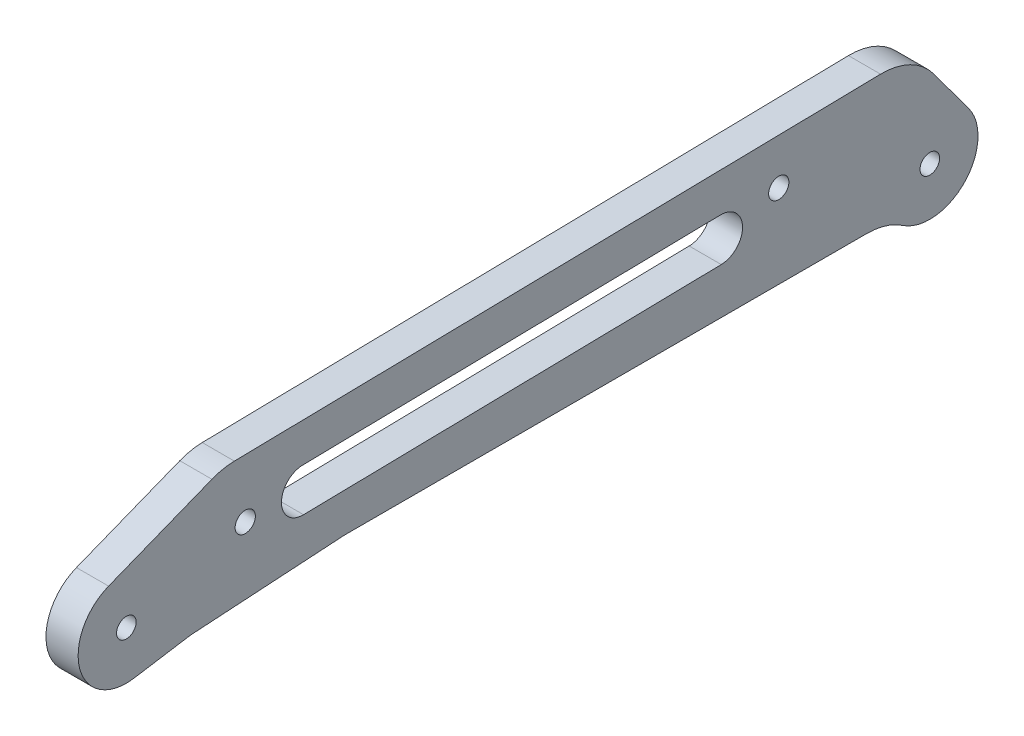
ISO-10303-21;
HEADER;
FILE_DESCRIPTION(('STEP AP214'),'2;1');
FILE_NAME('part.step','',(''),(''),'','','');
FILE_SCHEMA(('AUTOMOTIVE_DESIGN { 1 0 10303 214 1 1 1 1 }'));
ENDSEC;
DATA;
#1=APPLICATION_CONTEXT('core data for automotive mechanical design processes');
#2=APPLICATION_PROTOCOL_DEFINITION('international standard','automotive_design',2000,#1);
#3=PRODUCT_CONTEXT('',#1,'mechanical');
#4=PRODUCT('Part','Part','',(#3));
#5=PRODUCT_RELATED_PRODUCT_CATEGORY('part','',(#4));
#6=PRODUCT_DEFINITION_FORMATION('','',#4);
#7=PRODUCT_DEFINITION_CONTEXT('part definition',#1,'design');
#8=PRODUCT_DEFINITION('design','',#6,#7);
#9=PRODUCT_DEFINITION_SHAPE('','',#8);
#10=(LENGTH_UNIT() NAMED_UNIT(*) SI_UNIT(.MILLI.,.METRE.));
#11=(NAMED_UNIT(*) PLANE_ANGLE_UNIT() SI_UNIT($,.RADIAN.));
#12=(NAMED_UNIT(*) SI_UNIT($,.STERADIAN.) SOLID_ANGLE_UNIT());
#13=UNCERTAINTY_MEASURE_WITH_UNIT(LENGTH_MEASURE(1.E-05),#10,'distance_accuracy_value','');
#14=(GEOMETRIC_REPRESENTATION_CONTEXT(3) GLOBAL_UNCERTAINTY_ASSIGNED_CONTEXT((#13)) GLOBAL_UNIT_ASSIGNED_CONTEXT((#10,
#11,#12)) REPRESENTATION_CONTEXT('',''));
#15=CARTESIAN_POINT('',(0.,0.,0.));
#16=DIRECTION('',(0.,0.,1.));
#17=DIRECTION('',(1.,0.,0.));
#18=AXIS2_PLACEMENT_3D('',#15,#16,#17);
#19=CARTESIAN_POINT('',(2.5,-15.9506465412037,113.898149240446));
#20=DIRECTION('',(-1.,0.,0.));
#21=DIRECTION('',(0.,0.,1.));
#22=AXIS2_PLACEMENT_3D('',#19,#20,#21);
#23=CYLINDRICAL_SURFACE('',#22,9.99999999999999);
#24=DIRECTION('',(1.,0.,0.));
#25=VECTOR('',#24,1.);
#26=CARTESIAN_POINT('',(2.5,-6.0754365781553,115.473023262617));
#27=LINE('',#26,#25);
#28=CARTESIAN_POINT('',(-2.5,-6.0754365781553,115.473023262617));
#29=VERTEX_POINT('',#28);
#30=CARTESIAN_POINT('',(2.5,-6.0754365781553,115.473023262617));
#31=VERTEX_POINT('',#30);
#32=EDGE_CURVE('E142',#29,#31,#27,.T.);
#33=ORIENTED_EDGE('',*,*,#32,.F.);
#34=CARTESIAN_POINT('',(-2.5,-15.9506465412037,113.898149240446));
#35=DIRECTION('',(-1.,0.,0.));
#36=DIRECTION('',(0.,0.,1.));
#37=AXIS2_PLACEMENT_3D('',#34,#35,#36);
#38=CIRCLE('',#37,9.99999999999999);
#39=CARTESIAN_POINT('',(-2.5,-5.97012075637485,114.521932101997));
#40=VERTEX_POINT('',#39);
#41=EDGE_CURVE('E19',#40,#29,#38,.F.);
#42=ORIENTED_EDGE('',*,*,#41,.F.);
#43=DIRECTION('',(1.,0.,0.));
#44=VECTOR('',#43,1.);
#45=CARTESIAN_POINT('',(2.5,-5.97012075637486,114.521932101997));
#46=LINE('',#45,#44);
#47=CARTESIAN_POINT('',(2.5,-5.97012075637485,114.521932101997));
#48=VERTEX_POINT('',#47);
#49=EDGE_CURVE('E206',#40,#48,#46,.T.);
#50=ORIENTED_EDGE('',*,*,#49,.T.);
#51=CARTESIAN_POINT('',(2.5,-15.9506465412037,113.898149240446));
#52=DIRECTION('',(-1.,0.,0.));
#53=DIRECTION('',(0.,0.,1.));
#54=AXIS2_PLACEMENT_3D('',#51,#52,#53);
#55=CIRCLE('',#54,9.99999999999999);
#56=EDGE_CURVE('E140',#31,#48,#55,.T.);
#57=ORIENTED_EDGE('',*,*,#56,.F.);
#58=EDGE_LOOP('',(#33,#42,#50,#57));
#59=FACE_BOUND('',#58,.T.);
#60=ADVANCED_FACE('F16',(#59),#23,.F.);
#61=CARTESIAN_POINT('',(2.5,0.,0.));
#62=DIRECTION('',(1.,0.,0.));
#63=DIRECTION('',(0.,0.,-1.));
#64=AXIS2_PLACEMENT_3D('',#61,#62,#63);
#65=PLANE('',#64);
#66=CARTESIAN_POINT('',(2.5,0.,125.));
#67=DIRECTION('',(-1.,0.,0.));
#68=DIRECTION('',(0.,0.,1.));
#69=AXIS2_PLACEMENT_3D('',#66,#67,#68);
#70=CIRCLE('',#69,1.525);
#71=CARTESIAN_POINT('',(2.5,0.,126.525));
#72=VERTEX_POINT('',#71);
#73=EDGE_CURVE('E255',#72,#72,#70,.T.);
#74=ORIENTED_EDGE('',*,*,#73,.T.);
#75=EDGE_LOOP('',(#74));
#76=FACE_BOUND('',#75,.T.);
#77=CARTESIAN_POINT('',(2.5,8.49999999999999,23.5));
#78=DIRECTION('',(-1.,0.,0.));
#79=DIRECTION('',(0.,0.,1.));
#80=AXIS2_PLACEMENT_3D('',#77,#78,#79);
#81=CIRCLE('',#80,1.575);
#82=CARTESIAN_POINT('',(2.5,8.49999999999999,25.075));
#83=VERTEX_POINT('',#82);
#84=EDGE_CURVE('E167',#83,#83,#81,.T.);
#85=ORIENTED_EDGE('',*,*,#84,.T.);
#86=EDGE_LOOP('',(#85));
#87=FACE_BOUND('',#86,.T.);
#88=CARTESIAN_POINT('',(2.5,4.80591857120444,97.4943767977606));
#89=DIRECTION('',(-1.,0.,0.));
#90=DIRECTION('',(0.,0.,1.));
#91=AXIS2_PLACEMENT_3D('',#88,#89,#90);
#92=CIRCLE('',#91,3.375);
#93=CARTESIAN_POINT('',(2.5,1.43150251912931,97.4315969642336));
#94=VERTEX_POINT('',#93);
#95=CARTESIAN_POINT('',(2.5,8.18033462327958,97.5571566312875));
#96=VERTEX_POINT('',#95);
#97=EDGE_CURVE('E174',#94,#96,#92,.T.);
#98=ORIENTED_EDGE('',*,*,#97,.T.);
#99=DIRECTION('',(0.,-0.0186014321561423,0.999826978392632));
#100=VECTOR('',#99,1.);
#101=CARTESIAN_POINT('',(2.5,9.99189296650175,0.18589568309771));
#102=LINE('',#101,#100);
#103=CARTESIAN_POINT('',(2.5,9.38942771342883,32.5684030357665));
#104=VERTEX_POINT('',#103);
#105=EDGE_CURVE('E170',#96,#104,#102,.F.);
#106=ORIENTED_EDGE('',*,*,#105,.T.);
#107=CARTESIAN_POINT('',(2.5,6.01501166135369,32.5056232022395));
#108=DIRECTION('',(-1.,0.,0.));
#109=DIRECTION('',(0.,0.,1.));
#110=AXIS2_PLACEMENT_3D('',#107,#108,#109);
#111=CIRCLE('',#110,3.375);
#112=CARTESIAN_POINT('',(2.5,2.64059560927856,32.4428433687125));
#113=VERTEX_POINT('',#112);
#114=EDGE_CURVE('E168',#104,#113,#111,.T.);
#115=ORIENTED_EDGE('',*,*,#114,.T.);
#116=DIRECTION('',(0.,-0.0186014321561423,0.999826978392632));
#117=VECTOR('',#116,1.);
#118=CARTESIAN_POINT('',(2.5,3.24306086235148,0.0603360160437494));
#119=LINE('',#118,#117);
#120=EDGE_CURVE('E178',#94,#113,#119,.F.);
#121=ORIENTED_EDGE('',*,*,#120,.F.);
#122=EDGE_LOOP('',(#98,#106,#115,#121));
#123=FACE_BOUND('',#122,.T.);
#124=CARTESIAN_POINT('',(2.5,4.99999999999999,106.5));
#125=DIRECTION('',(-1.,0.,0.));
#126=DIRECTION('',(0.,0.,1.));
#127=AXIS2_PLACEMENT_3D('',#124,#125,#126);
#128=CIRCLE('',#127,1.57499999999999);
#129=CARTESIAN_POINT('',(2.5,4.99999999999999,108.075));
#130=VERTEX_POINT('',#129);
#131=EDGE_CURVE('E185',#130,#130,#128,.T.);
#132=ORIENTED_EDGE('',*,*,#131,.T.);
#133=EDGE_LOOP('',(#132));
#134=FACE_BOUND('',#133,.T.);
#135=CARTESIAN_POINT('',(2.5,-14.5,9.7979589711327));
#136=DIRECTION('',(-1.,0.,0.));
#137=DIRECTION('',(0.,0.,1.));
#138=AXIS2_PLACEMENT_3D('',#135,#136,#137);
#139=CIRCLE('',#138,10.);
#140=CARTESIAN_POINT('',(2.5,-4.50000000000001,9.7979589711327));
#141=VERTEX_POINT('',#140);
#142=CARTESIAN_POINT('',(2.5,-6.21428571428572,4.19912527334258));
#143=VERTEX_POINT('',#142);
#144=EDGE_CURVE('E198',#141,#143,#139,.T.);
#145=ORIENTED_EDGE('',*,*,#144,.T.);
#146=CARTESIAN_POINT('',(2.5,0.,0.));
#147=DIRECTION('',(-1.,0.,0.));
#148=DIRECTION('',(0.,0.,1.));
#149=AXIS2_PLACEMENT_3D('',#146,#147,#148);
#150=CIRCLE('',#149,7.5);
#151=CARTESIAN_POINT('',(2.5,4.4580100162827,-6.03126410420926));
#152=VERTEX_POINT('',#151);
#153=EDGE_CURVE('E194',#152,#143,#150,.T.);
#154=ORIENTED_EDGE('',*,*,#153,.F.);
#155=DIRECTION('',(0.,0.804168547227902,0.59440133550436));
#156=VECTOR('',#155,1.);
#157=CARTESIAN_POINT('',(2.5,4.4580100162827,-6.03126410420926));
#158=LINE('',#157,#156);
#159=CARTESIAN_POINT('',(2.5,11.8497428928066,-0.567663334640593));
#160=VERTEX_POINT('',#159);
#161=EDGE_CURVE('E191',#160,#152,#158,.F.);
#162=ORIENTED_EDGE('',*,*,#161,.F.);
#163=CARTESIAN_POINT('',(2.5,5.90572953776299,7.47402213763842));
#164=DIRECTION('',(-1.,0.,0.));
#165=DIRECTION('',(0.,0.,1.));
#166=AXIS2_PLACEMENT_3D('',#163,#164,#165);
#167=CIRCLE('',#166,10.);
#168=CARTESIAN_POINT('',(2.5,15.9039993216893,7.66003645919984));
#169=VERTEX_POINT('',#168);
#170=EDGE_CURVE('E188',#169,#160,#167,.T.);
#171=ORIENTED_EDGE('',*,*,#170,.F.);
#172=DIRECTION('',(0.,-0.0186014321561421,0.999826978392632));
#173=VECTOR('',#172,1.);
#174=CARTESIAN_POINT('',(2.5,16.040959321814,0.298436452498867));
#175=LINE('',#174,#173);
#176=CARTESIAN_POINT('',(2.5,14.0336689941836,108.190291562629));
#177=VERTEX_POINT('',#176);
#178=EDGE_CURVE('E182',#177,#169,#175,.F.);
#179=ORIENTED_EDGE('',*,*,#178,.F.);
#180=CARTESIAN_POINT('',(2.5,4.03539921025731,108.004277241067));
#181=DIRECTION('',(-1.,0.,0.));
#182=DIRECTION('',(0.,0.,1.));
#183=AXIS2_PLACEMENT_3D('',#180,#181,#182);
#184=CIRCLE('',#183,9.99999999999999);
#185=CARTESIAN_POINT('',(2.5,13.3341269732446,111.683089819856));
#186=VERTEX_POINT('',#185);
#187=EDGE_CURVE('E226',#186,#177,#184,.T.);
#188=ORIENTED_EDGE('',*,*,#187,.F.);
#189=DIRECTION('',(0.,-0.367881257878812,0.929872776298727));
#190=VECTOR('',#189,1.);
#191=CARTESIAN_POINT('',(2.5,49.7343916487453,19.6761869214032));
#192=LINE('',#191,#190);
#193=CARTESIAN_POINT('',(2.5,6.97404582224044,127.759109434091));
#194=VERTEX_POINT('',#193);
#195=EDGE_CURVE('E213',#194,#186,#192,.F.);
#196=ORIENTED_EDGE('',*,*,#195,.F.);
#197=CARTESIAN_POINT('',(2.5,0.,125.));
#198=DIRECTION('',(-1.,0.,0.));
#199=DIRECTION('',(0.,0.,1.));
#200=AXIS2_PLACEMENT_3D('',#197,#198,#199);
#201=CIRCLE('',#200,7.50000000000001);
#202=CARTESIAN_POINT('',(2.5,-7.40640747228635,123.818844483372));
#203=VERTEX_POINT('',#202);
#204=EDGE_CURVE('E146',#203,#194,#201,.T.);
#205=ORIENTED_EDGE('',*,*,#204,.F.);
#206=DIRECTION('',(0.,0.157487402217094,-0.987520996304844));
#207=VECTOR('',#206,1.);
#208=CARTESIAN_POINT('',(2.5,12.0338570705745,1.9191297155079));
#209=LINE('',#208,#207);
#210=EDGE_CURVE('E145',#31,#203,#209,.F.);
#211=ORIENTED_EDGE('',*,*,#210,.F.);
#212=ORIENTED_EDGE('',*,*,#56,.T.);
#213=DIRECTION('',(0.,-0.0623782861551807,0.998052578482889));
#214=VECTOR('',#213,1.);
#215=CARTESIAN_POINT('',(2.5,1.18287937743191,0.0739299610894947));
#216=LINE('',#215,#214);
#217=CARTESIAN_POINT('',(2.5,-4.50000000000001,91.));
#218=VERTEX_POINT('',#217);
#219=EDGE_CURVE('E203',#48,#218,#216,.F.);
#220=ORIENTED_EDGE('',*,*,#219,.T.);
#221=DIRECTION('',(0.,0.,1.));
#222=VECTOR('',#221,1.);
#223=CARTESIAN_POINT('',(2.5,-4.50000000000001,0.));
#224=LINE('',#223,#222);
#225=EDGE_CURVE('E199',#218,#141,#224,.F.);
#226=ORIENTED_EDGE('',*,*,#225,.T.);
#227=EDGE_LOOP('',(#145,#154,#162,#171,#179,#188,#196,#205,#211,#212,#220,#226));
#228=FACE_BOUND('',#227,.T.);
#229=CARTESIAN_POINT('',(2.5,0.,0.));
#230=DIRECTION('',(-1.,0.,0.));
#231=DIRECTION('',(0.,0.,1.));
#232=AXIS2_PLACEMENT_3D('',#229,#230,#231);
#233=CIRCLE('',#232,1.525);
#234=CARTESIAN_POINT('',(2.5,0.,1.525));
#235=VERTEX_POINT('',#234);
#236=EDGE_CURVE('E271',#235,#235,#233,.T.);
#237=ORIENTED_EDGE('',*,*,#236,.T.);
#238=EDGE_LOOP('',(#237));
#239=FACE_BOUND('',#238,.T.);
#240=ADVANCED_FACE('F275',(#76,#87,#123,#134,#228,#239),#65,.T.);
#241=CARTESIAN_POINT('',(2.5,0.,0.));
#242=DIRECTION('',(-1.,0.,0.));
#243=DIRECTION('',(0.,0.,1.));
#244=AXIS2_PLACEMENT_3D('',#241,#242,#243);
#245=CYLINDRICAL_SURFACE('',#244,1.525);
#246=CARTESIAN_POINT('',(-2.5,0.,0.));
#247=DIRECTION('',(-1.,0.,0.));
#248=DIRECTION('',(0.,0.,1.));
#249=AXIS2_PLACEMENT_3D('',#246,#247,#248);
#250=CIRCLE('',#249,1.525);
#251=CARTESIAN_POINT('',(-2.5,0.,1.525));
#252=VERTEX_POINT('',#251);
#253=EDGE_CURVE('E252',#252,#252,#250,.T.);
#254=ORIENTED_EDGE('',*,*,#253,.T.);
#255=EDGE_LOOP('',(#254));
#256=FACE_BOUND('',#255,.T.);
#257=ORIENTED_EDGE('',*,*,#236,.F.);
#258=EDGE_LOOP('',(#257));
#259=FACE_BOUND('',#258,.T.);
#260=ADVANCED_FACE('F485',(#256,#259),#245,.F.);
#261=CARTESIAN_POINT('',(2.5,4.03539921025731,108.004277241067));
#262=DIRECTION('',(-1.,0.,0.));
#263=DIRECTION('',(0.,0.,1.));
#264=AXIS2_PLACEMENT_3D('',#261,#262,#263);
#265=CYLINDRICAL_SURFACE('',#264,9.99999999999999);
#266=CARTESIAN_POINT('',(-2.5,4.03539921025731,108.004277241067));
#267=DIRECTION('',(-1.,0.,0.));
#268=DIRECTION('',(0.,0.,1.));
#269=AXIS2_PLACEMENT_3D('',#266,#267,#268);
#270=CIRCLE('',#269,9.99999999999999);
#271=CARTESIAN_POINT('',(-2.5,14.0336689941836,108.190291562629));
#272=VERTEX_POINT('',#271);
#273=CARTESIAN_POINT('',(-2.5,13.3341269732446,111.683089819856));
#274=VERTEX_POINT('',#273);
#275=EDGE_CURVE('E163',#272,#274,#270,.F.);
#276=ORIENTED_EDGE('',*,*,#275,.T.);
#277=DIRECTION('',(1.,0.,0.));
#278=VECTOR('',#277,1.);
#279=CARTESIAN_POINT('',(2.5,13.3341269732446,111.683089819856));
#280=LINE('',#279,#278);
#281=EDGE_CURVE('E211',#186,#274,#280,.F.);
#282=ORIENTED_EDGE('',*,*,#281,.F.);
#283=ORIENTED_EDGE('',*,*,#187,.T.);
#284=DIRECTION('',(1.,0.,0.));
#285=VECTOR('',#284,1.);
#286=CARTESIAN_POINT('',(2.5,14.0336689941836,108.190291562629));
#287=LINE('',#286,#285);
#288=EDGE_CURVE('E181',#272,#177,#287,.T.);
#289=ORIENTED_EDGE('',*,*,#288,.F.);
#290=EDGE_LOOP('',(#276,#282,#283,#289));
#291=FACE_BOUND('',#290,.T.);
#292=ADVANCED_FACE('F476',(#291),#265,.T.);
#293=CARTESIAN_POINT('',(2.5,49.7343916487453,19.6761869214032));
#294=DIRECTION('',(0.,0.929872776298727,0.367881257878812));
#295=DIRECTION('',(0.,-0.367881257878812,0.929872776298727));
#296=AXIS2_PLACEMENT_3D('',#293,#294,#295);
#297=PLANE('',#296);
#298=DIRECTION('',(0.,-0.367881257878812,0.929872776298727));
#299=VECTOR('',#298,1.);
#300=CARTESIAN_POINT('',(-2.5,13.3341269732446,111.683089819856));
#301=LINE('',#300,#299);
#302=CARTESIAN_POINT('',(-2.5,6.97404582224044,127.759109434091));
#303=VERTEX_POINT('',#302);
#304=EDGE_CURVE('E156',#274,#303,#301,.T.);
#305=ORIENTED_EDGE('',*,*,#304,.T.);
#306=DIRECTION('',(-1.,0.,0.));
#307=VECTOR('',#306,1.);
#308=CARTESIAN_POINT('',(2.5,6.97404582224044,127.759109434091));
#309=LINE('',#308,#307);
#310=EDGE_CURVE('E209',#194,#303,#309,.T.);
#311=ORIENTED_EDGE('',*,*,#310,.F.);
#312=ORIENTED_EDGE('',*,*,#195,.T.);
#313=ORIENTED_EDGE('',*,*,#281,.T.);
#314=EDGE_LOOP('',(#305,#311,#312,#313));
#315=FACE_BOUND('',#314,.T.);
#316=ADVANCED_FACE('F467',(#315),#297,.T.);
#317=CARTESIAN_POINT('',(2.5,0.,125.));
#318=DIRECTION('',(-1.,0.,0.));
#319=DIRECTION('',(0.,0.,1.));
#320=AXIS2_PLACEMENT_3D('',#317,#318,#319);
#321=CYLINDRICAL_SURFACE('',#320,7.50000000000001);
#322=CARTESIAN_POINT('',(-2.5,0.,125.));
#323=DIRECTION('',(-1.,0.,0.));
#324=DIRECTION('',(0.,0.,1.));
#325=AXIS2_PLACEMENT_3D('',#322,#323,#324);
#326=CIRCLE('',#325,7.50000000000001);
#327=CARTESIAN_POINT('',(-2.5,-7.40640747228635,123.818844483372));
#328=VERTEX_POINT('',#327);
#329=EDGE_CURVE('E152',#303,#328,#326,.F.);
#330=ORIENTED_EDGE('',*,*,#329,.T.);
#331=DIRECTION('',(1.,0.,0.));
#332=VECTOR('',#331,1.);
#333=CARTESIAN_POINT('',(2.5,-7.40640747228635,123.818844483372));
#334=LINE('',#333,#332);
#335=EDGE_CURVE('E151',#203,#328,#334,.F.);
#336=ORIENTED_EDGE('',*,*,#335,.F.);
#337=ORIENTED_EDGE('',*,*,#204,.T.);
#338=ORIENTED_EDGE('',*,*,#310,.T.);
#339=EDGE_LOOP('',(#330,#336,#337,#338));
#340=FACE_BOUND('',#339,.T.);
#341=ADVANCED_FACE('F459',(#340),#321,.T.);
#342=CARTESIAN_POINT('',(2.5,12.0338570705745,1.9191297155079));
#343=DIRECTION('',(0.,-0.987520996304844,-0.157487402217094));
#344=DIRECTION('',(0.,0.157487402217094,-0.987520996304844));
#345=AXIS2_PLACEMENT_3D('',#342,#343,#344);
#346=PLANE('',#345);
#347=ORIENTED_EDGE('',*,*,#210,.T.);
#348=ORIENTED_EDGE('',*,*,#335,.T.);
#349=DIRECTION('',(0.,0.157487402217095,-0.987520996304844));
#350=VECTOR('',#349,1.);
#351=CARTESIAN_POINT('',(-2.5,-7.40640747228635,123.818844483372));
#352=LINE('',#351,#350);
#353=EDGE_CURVE('E136',#328,#29,#352,.T.);
#354=ORIENTED_EDGE('',*,*,#353,.T.);
#355=ORIENTED_EDGE('',*,*,#32,.T.);
#356=EDGE_LOOP('',(#347,#348,#354,#355));
#357=FACE_BOUND('',#356,.T.);
#358=ADVANCED_FACE('F149',(#357),#346,.T.);
#359=CARTESIAN_POINT('',(2.5,1.18287937743191,0.0739299610894947));
#360=DIRECTION('',(0.,0.998052578482889,0.0623782861551807));
#361=DIRECTION('',(0.,-0.0623782861551807,0.998052578482889));
#362=AXIS2_PLACEMENT_3D('',#359,#360,#361);
#363=PLANE('',#362);
#364=ORIENTED_EDGE('',*,*,#49,.F.);
#365=DIRECTION('',(0.,0.0623782861551807,-0.998052578482889));
#366=VECTOR('',#365,1.);
#367=CARTESIAN_POINT('',(-2.5,-5.97012075637486,114.521932101997));
#368=LINE('',#367,#366);
#369=CARTESIAN_POINT('',(-2.5,-4.50000000000003,91.0000000000006));
#370=VERTEX_POINT('',#369);
#371=EDGE_CURVE('E139',#40,#370,#368,.T.);
#372=ORIENTED_EDGE('',*,*,#371,.T.);
#373=DIRECTION('',(1.,0.,0.));
#374=VECTOR('',#373,1.);
#375=CARTESIAN_POINT('',(2.5,-4.50000000000001,91.));
#376=LINE('',#375,#374);
#377=EDGE_CURVE('E200',#370,#218,#376,.T.);
#378=ORIENTED_EDGE('',*,*,#377,.T.);
#379=ORIENTED_EDGE('',*,*,#219,.F.);
#380=EDGE_LOOP('',(#364,#372,#378,#379));
#381=FACE_BOUND('',#380,.T.);
#382=ADVANCED_FACE('F280',(#381),#363,.F.);
#383=CARTESIAN_POINT('',(2.5,-4.50000000000001,0.));
#384=DIRECTION('',(0.,1.,0.));
#385=DIRECTION('',(0.,0.,1.));
#386=AXIS2_PLACEMENT_3D('',#383,#384,#385);
#387=PLANE('',#386);
#388=DIRECTION('',(-1.,0.,0.));
#389=VECTOR('',#388,1.);
#390=CARTESIAN_POINT('',(2.5,-4.50000000000001,9.7979589711327));
#391=LINE('',#390,#389);
#392=CARTESIAN_POINT('',(-2.5,-4.50000000000001,9.7979589711327));
#393=VERTEX_POINT('',#392);
#394=EDGE_CURVE('E195',#393,#141,#391,.F.);
#395=ORIENTED_EDGE('',*,*,#394,.T.);
#396=ORIENTED_EDGE('',*,*,#225,.F.);
#397=ORIENTED_EDGE('',*,*,#377,.F.);
#398=DIRECTION('',(0.,0.,-1.));
#399=VECTOR('',#398,1.);
#400=CARTESIAN_POINT('',(-2.5,-4.50000000000001,0.));
#401=LINE('',#400,#399);
#402=EDGE_CURVE('E154',#370,#393,#401,.T.);
#403=ORIENTED_EDGE('',*,*,#402,.T.);
#404=EDGE_LOOP('',(#395,#396,#397,#403));
#405=FACE_BOUND('',#404,.T.);
#406=ADVANCED_FACE('F283',(#405),#387,.F.);
#407=CARTESIAN_POINT('',(2.5,-14.5,9.7979589711327));
#408=DIRECTION('',(-1.,0.,0.));
#409=DIRECTION('',(0.,0.,1.));
#410=AXIS2_PLACEMENT_3D('',#407,#408,#409);
#411=CYLINDRICAL_SURFACE('',#410,10.);
#412=ORIENTED_EDGE('',*,*,#394,.F.);
#413=CARTESIAN_POINT('',(-2.5,-14.5,9.7979589711327));
#414=DIRECTION('',(-1.,0.,0.));
#415=DIRECTION('',(0.,0.,1.));
#416=AXIS2_PLACEMENT_3D('',#413,#414,#415);
#417=CIRCLE('',#416,10.);
#418=CARTESIAN_POINT('',(-2.5,-6.21428571428572,4.19912527334258));
#419=VERTEX_POINT('',#418);
#420=EDGE_CURVE('E247',#393,#419,#417,.T.);
#421=ORIENTED_EDGE('',*,*,#420,.T.);
#422=DIRECTION('',(-1.,0.,0.));
#423=VECTOR('',#422,1.);
#424=CARTESIAN_POINT('',(2.5,-6.21428571428572,4.19912527334258));
#425=LINE('',#424,#423);
#426=EDGE_CURVE('E192',#143,#419,#425,.T.);
#427=ORIENTED_EDGE('',*,*,#426,.F.);
#428=ORIENTED_EDGE('',*,*,#144,.F.);
#429=EDGE_LOOP('',(#412,#421,#427,#428));
#430=FACE_BOUND('',#429,.T.);
#431=ADVANCED_FACE('F428',(#430),#411,.F.);
#432=CARTESIAN_POINT('',(2.5,0.,0.));
#433=DIRECTION('',(-1.,0.,0.));
#434=DIRECTION('',(0.,0.,1.));
#435=AXIS2_PLACEMENT_3D('',#432,#433,#434);
#436=CYLINDRICAL_SURFACE('',#435,7.5);
#437=CARTESIAN_POINT('',(-2.5,0.,0.));
#438=DIRECTION('',(-1.,0.,0.));
#439=DIRECTION('',(0.,0.,1.));
#440=AXIS2_PLACEMENT_3D('',#437,#438,#439);
#441=CIRCLE('',#440,7.5);
#442=CARTESIAN_POINT('',(-2.5,4.4580100162827,-6.03126410420926));
#443=VERTEX_POINT('',#442);
#444=EDGE_CURVE('E244',#419,#443,#441,.F.);
#445=ORIENTED_EDGE('',*,*,#444,.T.);
#446=DIRECTION('',(1.,0.,0.));
#447=VECTOR('',#446,1.);
#448=CARTESIAN_POINT('',(2.5,4.4580100162827,-6.03126410420926));
#449=LINE('',#448,#447);
#450=EDGE_CURVE('E189',#152,#443,#449,.F.);
#451=ORIENTED_EDGE('',*,*,#450,.F.);
#452=ORIENTED_EDGE('',*,*,#153,.T.);
#453=ORIENTED_EDGE('',*,*,#426,.T.);
#454=EDGE_LOOP('',(#445,#451,#452,#453));
#455=FACE_BOUND('',#454,.T.);
#456=ADVANCED_FACE('F419',(#455),#436,.T.);
#457=CARTESIAN_POINT('',(2.5,4.4580100162827,-6.03126410420926));
#458=DIRECTION('',(0.,0.59440133550436,-0.804168547227902));
#459=DIRECTION('',(0.,0.804168547227902,0.59440133550436));
#460=AXIS2_PLACEMENT_3D('',#457,#458,#459);
#461=PLANE('',#460);
#462=ORIENTED_EDGE('',*,*,#161,.T.);
#463=ORIENTED_EDGE('',*,*,#450,.T.);
#464=DIRECTION('',(0.,0.804168547227902,0.59440133550436));
#465=VECTOR('',#464,1.);
#466=CARTESIAN_POINT('',(-2.5,4.4580100162827,-6.03126410420926));
#467=LINE('',#466,#465);
#468=CARTESIAN_POINT('',(-2.5,11.8497428928066,-0.567663334640593));
#469=VERTEX_POINT('',#468);
#470=EDGE_CURVE('E243',#443,#469,#467,.T.);
#471=ORIENTED_EDGE('',*,*,#470,.T.);
#472=DIRECTION('',(-1.,0.,0.));
#473=VECTOR('',#472,1.);
#474=CARTESIAN_POINT('',(2.5,11.8497428928066,-0.567663334640591));
#475=LINE('',#474,#473);
#476=EDGE_CURVE('E186',#160,#469,#475,.T.);
#477=ORIENTED_EDGE('',*,*,#476,.F.);
#478=EDGE_LOOP('',(#462,#463,#471,#477));
#479=FACE_BOUND('',#478,.T.);
#480=ADVANCED_FACE('F410',(#479),#461,.T.);
#481=CARTESIAN_POINT('',(2.5,5.90572953776299,7.47402213763842));
#482=DIRECTION('',(-1.,0.,0.));
#483=DIRECTION('',(0.,0.,1.));
#484=AXIS2_PLACEMENT_3D('',#481,#482,#483);
#485=CYLINDRICAL_SURFACE('',#484,10.);
#486=CARTESIAN_POINT('',(-2.5,5.90572953776299,7.47402213763842));
#487=DIRECTION('',(-1.,0.,0.));
#488=DIRECTION('',(0.,0.,1.));
#489=AXIS2_PLACEMENT_3D('',#486,#487,#488);
#490=CIRCLE('',#489,10.);
#491=CARTESIAN_POINT('',(-2.5,15.9039993216893,7.66003645919984));
#492=VERTEX_POINT('',#491);
#493=EDGE_CURVE('E240',#469,#492,#490,.F.);
#494=ORIENTED_EDGE('',*,*,#493,.T.);
#495=DIRECTION('',(1.,0.,0.));
#496=VECTOR('',#495,1.);
#497=CARTESIAN_POINT('',(2.5,15.9039993216893,7.66003645919984));
#498=LINE('',#497,#496);
#499=EDGE_CURVE('E179',#169,#492,#498,.F.);
#500=ORIENTED_EDGE('',*,*,#499,.F.);
#501=ORIENTED_EDGE('',*,*,#170,.T.);
#502=ORIENTED_EDGE('',*,*,#476,.T.);
#503=EDGE_LOOP('',(#494,#500,#501,#502));
#504=FACE_BOUND('',#503,.T.);
#505=ADVANCED_FACE('F401',(#504),#485,.T.);
#506=CARTESIAN_POINT('',(2.5,16.040959321814,0.298436452498867));
#507=DIRECTION('',(0.,0.999826978392632,0.0186014321561421));
#508=DIRECTION('',(0.,-0.0186014321561421,0.999826978392632));
#509=AXIS2_PLACEMENT_3D('',#506,#507,#508);
#510=PLANE('',#509);
#511=DIRECTION('',(0.,-0.0186014321561421,0.999826978392632));
#512=VECTOR('',#511,1.);
#513=CARTESIAN_POINT('',(-2.5,15.9039993216893,7.66003645919984));
#514=LINE('',#513,#512);
#515=EDGE_CURVE('E239',#492,#272,#514,.T.);
#516=ORIENTED_EDGE('',*,*,#515,.T.);
#517=ORIENTED_EDGE('',*,*,#288,.T.);
#518=ORIENTED_EDGE('',*,*,#178,.T.);
#519=ORIENTED_EDGE('',*,*,#499,.T.);
#520=EDGE_LOOP('',(#516,#517,#518,#519));
#521=FACE_BOUND('',#520,.T.);
#522=ADVANCED_FACE('F323',(#521),#510,.T.);
#523=CARTESIAN_POINT('',(2.5,4.99999999999999,106.5));
#524=DIRECTION('',(-1.,0.,0.));
#525=DIRECTION('',(0.,0.,1.));
#526=AXIS2_PLACEMENT_3D('',#523,#524,#525);
#527=CYLINDRICAL_SURFACE('',#526,1.57499999999999);
#528=CARTESIAN_POINT('',(-2.5,4.99999999999999,106.5));
#529=DIRECTION('',(-1.,0.,0.));
#530=DIRECTION('',(0.,0.,1.));
#531=AXIS2_PLACEMENT_3D('',#528,#529,#530);
#532=CIRCLE('',#531,1.57499999999999);
#533=CARTESIAN_POINT('',(-2.5,4.99999999999999,108.075));
#534=VERTEX_POINT('',#533);
#535=EDGE_CURVE('E236',#534,#534,#532,.T.);
#536=ORIENTED_EDGE('',*,*,#535,.T.);
#537=EDGE_LOOP('',(#536));
#538=FACE_BOUND('',#537,.T.);
#539=ORIENTED_EDGE('',*,*,#131,.F.);
#540=EDGE_LOOP('',(#539));
#541=FACE_BOUND('',#540,.T.);
#542=ADVANCED_FACE('F315',(#538,#541),#527,.F.);
#543=CARTESIAN_POINT('',(2.5,3.24306086235148,0.0603360160437494));
#544=DIRECTION('',(0.,0.999826978392632,0.0186014321561423));
#545=DIRECTION('',(0.,-0.0186014321561423,0.999826978392632));
#546=AXIS2_PLACEMENT_3D('',#543,#544,#545);
#547=PLANE('',#546);
#548=ORIENTED_EDGE('',*,*,#120,.T.);
#549=DIRECTION('',(-1.,0.,0.));
#550=VECTOR('',#549,1.);
#551=CARTESIAN_POINT('',(2.5,2.64059560927856,32.4428433687125));
#552=LINE('',#551,#550);
#553=CARTESIAN_POINT('',(-2.5,2.64059560927856,32.4428433687125));
#554=VERTEX_POINT('',#553);
#555=EDGE_CURVE('E164',#113,#554,#552,.T.);
#556=ORIENTED_EDGE('',*,*,#555,.T.);
#557=DIRECTION('',(0.,-0.0186014321561423,0.999826978392632));
#558=VECTOR('',#557,1.);
#559=CARTESIAN_POINT('',(-2.5,2.64059560927856,32.4428433687125));
#560=LINE('',#559,#558);
#561=CARTESIAN_POINT('',(-2.5,1.43150251912931,97.4315969642336));
#562=VERTEX_POINT('',#561);
#563=EDGE_CURVE('E235',#554,#562,#560,.T.);
#564=ORIENTED_EDGE('',*,*,#563,.T.);
#565=DIRECTION('',(-1.,0.,0.));
#566=VECTOR('',#565,1.);
#567=CARTESIAN_POINT('',(2.5,1.43150251912931,97.4315969642336));
#568=LINE('',#567,#566);
#569=EDGE_CURVE('E175',#562,#94,#568,.F.);
#570=ORIENTED_EDGE('',*,*,#569,.T.);
#571=EDGE_LOOP('',(#548,#556,#564,#570));
#572=FACE_BOUND('',#571,.T.);
#573=ADVANCED_FACE('F313',(#572),#547,.T.);
#574=CARTESIAN_POINT('',(2.5,4.80591857120444,97.4943767977606));
#575=DIRECTION('',(-1.,0.,0.));
#576=DIRECTION('',(0.,0.,1.));
#577=AXIS2_PLACEMENT_3D('',#574,#575,#576);
#578=CYLINDRICAL_SURFACE('',#577,3.375);
#579=ORIENTED_EDGE('',*,*,#97,.F.);
#580=ORIENTED_EDGE('',*,*,#569,.F.);
#581=CARTESIAN_POINT('',(-2.5,4.80591857120444,97.4943767977606));
#582=DIRECTION('',(-1.,0.,0.));
#583=DIRECTION('',(0.,0.,1.));
#584=AXIS2_PLACEMENT_3D('',#581,#582,#583);
#585=CIRCLE('',#584,3.375);
#586=CARTESIAN_POINT('',(-2.5,8.18033462327958,97.5571566312876));
#587=VERTEX_POINT('',#586);
#588=EDGE_CURVE('E233',#562,#587,#585,.T.);
#589=ORIENTED_EDGE('',*,*,#588,.T.);
#590=DIRECTION('',(1.,0.,0.));
#591=VECTOR('',#590,1.);
#592=CARTESIAN_POINT('',(2.5,8.18033462327958,97.5571566312876));
#593=LINE('',#592,#591);
#594=EDGE_CURVE('E171',#587,#96,#593,.T.);
#595=ORIENTED_EDGE('',*,*,#594,.T.);
#596=EDGE_LOOP('',(#579,#580,#589,#595));
#597=FACE_BOUND('',#596,.T.);
#598=ADVANCED_FACE('F312',(#597),#578,.F.);
#599=CARTESIAN_POINT('',(2.5,9.99189296650175,0.18589568309771));
#600=DIRECTION('',(0.,0.999826978392632,0.0186014321561423));
#601=DIRECTION('',(0.,-0.0186014321561423,0.999826978392632));
#602=AXIS2_PLACEMENT_3D('',#599,#600,#601);
#603=PLANE('',#602);
#604=DIRECTION('',(-1.,0.,0.));
#605=VECTOR('',#604,1.);
#606=CARTESIAN_POINT('',(2.5,9.38942771342883,32.5684030357665));
#607=LINE('',#606,#605);
#608=CARTESIAN_POINT('',(-2.5,9.38942771342883,32.5684030357665));
#609=VERTEX_POINT('',#608);
#610=EDGE_CURVE('E34',#609,#104,#607,.F.);
#611=ORIENTED_EDGE('',*,*,#610,.T.);
#612=ORIENTED_EDGE('',*,*,#105,.F.);
#613=ORIENTED_EDGE('',*,*,#594,.F.);
#614=DIRECTION('',(0.,0.0186014321561423,-0.999826978392632));
#615=VECTOR('',#614,1.);
#616=CARTESIAN_POINT('',(-2.5,8.18033462327958,97.5571566312875));
#617=LINE('',#616,#615);
#618=EDGE_CURVE('E232',#587,#609,#617,.T.);
#619=ORIENTED_EDGE('',*,*,#618,.T.);
#620=EDGE_LOOP('',(#611,#612,#613,#619));
#621=FACE_BOUND('',#620,.T.);
#622=ADVANCED_FACE('F300',(#621),#603,.F.);
#623=CARTESIAN_POINT('',(2.5,6.01501166135369,32.5056232022395));
#624=DIRECTION('',(-1.,0.,0.));
#625=DIRECTION('',(0.,0.,1.));
#626=AXIS2_PLACEMENT_3D('',#623,#624,#625);
#627=CYLINDRICAL_SURFACE('',#626,3.375);
#628=ORIENTED_EDGE('',*,*,#555,.F.);
#629=ORIENTED_EDGE('',*,*,#114,.F.);
#630=ORIENTED_EDGE('',*,*,#610,.F.);
#631=CARTESIAN_POINT('',(-2.5,6.01501166135369,32.5056232022395));
#632=DIRECTION('',(-1.,0.,0.));
#633=DIRECTION('',(0.,0.,1.));
#634=AXIS2_PLACEMENT_3D('',#631,#632,#633);
#635=CIRCLE('',#634,3.375);
#636=EDGE_CURVE('E230',#609,#554,#635,.T.);
#637=ORIENTED_EDGE('',*,*,#636,.T.);
#638=EDGE_LOOP('',(#628,#629,#630,#637));
#639=FACE_BOUND('',#638,.T.);
#640=ADVANCED_FACE('F306',(#639),#627,.F.);
#641=CARTESIAN_POINT('',(2.5,8.49999999999999,23.5));
#642=DIRECTION('',(-1.,0.,0.));
#643=DIRECTION('',(0.,0.,1.));
#644=AXIS2_PLACEMENT_3D('',#641,#642,#643);
#645=CYLINDRICAL_SURFACE('',#644,1.575);
#646=CARTESIAN_POINT('',(-2.5,8.49999999999999,23.5));
#647=DIRECTION('',(-1.,0.,0.));
#648=DIRECTION('',(0.,0.,1.));
#649=AXIS2_PLACEMENT_3D('',#646,#647,#648);
#650=CIRCLE('',#649,1.575);
#651=CARTESIAN_POINT('',(-2.5,8.49999999999999,25.075));
#652=VERTEX_POINT('',#651);
#653=EDGE_CURVE('E25',#652,#652,#650,.T.);
#654=ORIENTED_EDGE('',*,*,#653,.T.);
#655=EDGE_LOOP('',(#654));
#656=FACE_BOUND('',#655,.T.);
#657=ORIENTED_EDGE('',*,*,#84,.F.);
#658=EDGE_LOOP('',(#657));
#659=FACE_BOUND('',#658,.T.);
#660=ADVANCED_FACE('F333',(#656,#659),#645,.F.);
#661=CARTESIAN_POINT('',(2.5,0.,125.));
#662=DIRECTION('',(-1.,0.,0.));
#663=DIRECTION('',(0.,0.,1.));
#664=AXIS2_PLACEMENT_3D('',#661,#662,#663);
#665=CYLINDRICAL_SURFACE('',#664,1.525);
#666=CARTESIAN_POINT('',(-2.5,0.,125.));
#667=DIRECTION('',(-1.,0.,0.));
#668=DIRECTION('',(0.,0.,1.));
#669=AXIS2_PLACEMENT_3D('',#666,#667,#668);
#670=CIRCLE('',#669,1.525);
#671=CARTESIAN_POINT('',(-2.5,0.,126.525));
#672=VERTEX_POINT('',#671);
#673=EDGE_CURVE('E11',#672,#672,#670,.T.);
#674=ORIENTED_EDGE('',*,*,#673,.T.);
#675=EDGE_LOOP('',(#674));
#676=FACE_BOUND('',#675,.T.);
#677=ORIENTED_EDGE('',*,*,#73,.F.);
#678=EDGE_LOOP('',(#677));
#679=FACE_BOUND('',#678,.T.);
#680=ADVANCED_FACE('F327',(#676,#679),#665,.F.);
#681=CARTESIAN_POINT('',(-2.5,0.,0.));
#682=DIRECTION('',(1.,0.,0.));
#683=DIRECTION('',(0.,0.,-1.));
#684=AXIS2_PLACEMENT_3D('',#681,#682,#683);
#685=PLANE('',#684);
#686=ORIENTED_EDGE('',*,*,#673,.F.);
#687=EDGE_LOOP('',(#686));
#688=FACE_BOUND('',#687,.T.);
#689=ORIENTED_EDGE('',*,*,#653,.F.);
#690=EDGE_LOOP('',(#689));
#691=FACE_BOUND('',#690,.T.);
#692=ORIENTED_EDGE('',*,*,#618,.F.);
#693=ORIENTED_EDGE('',*,*,#588,.F.);
#694=ORIENTED_EDGE('',*,*,#563,.F.);
#695=ORIENTED_EDGE('',*,*,#636,.F.);
#696=EDGE_LOOP('',(#692,#693,#694,#695));
#697=FACE_BOUND('',#696,.T.);
#698=ORIENTED_EDGE('',*,*,#535,.F.);
#699=EDGE_LOOP('',(#698));
#700=FACE_BOUND('',#699,.T.);
#701=ORIENTED_EDGE('',*,*,#493,.F.);
#702=ORIENTED_EDGE('',*,*,#470,.F.);
#703=ORIENTED_EDGE('',*,*,#444,.F.);
#704=ORIENTED_EDGE('',*,*,#420,.F.);
#705=ORIENTED_EDGE('',*,*,#402,.F.);
#706=ORIENTED_EDGE('',*,*,#371,.F.);
#707=ORIENTED_EDGE('',*,*,#41,.T.);
#708=ORIENTED_EDGE('',*,*,#353,.F.);
#709=ORIENTED_EDGE('',*,*,#329,.F.);
#710=ORIENTED_EDGE('',*,*,#304,.F.);
#711=ORIENTED_EDGE('',*,*,#275,.F.);
#712=ORIENTED_EDGE('',*,*,#515,.F.);
#713=EDGE_LOOP('',(#701,#702,#703,#704,#705,#706,#707,#708,#709,#710,#711,#712));
#714=FACE_BOUND('',#713,.T.);
#715=ORIENTED_EDGE('',*,*,#253,.F.);
#716=EDGE_LOOP('',(#715));
#717=FACE_BOUND('',#716,.T.);
#718=ADVANCED_FACE('F132',(#688,#691,#697,#700,#714,#717),#685,.F.);
#719=CLOSED_SHELL('',(#60,#240,#260,#292,#316,#341,#358,#382,#406,#431,#456,#480,#505,#522,#542,
#573,#598,#622,#640,#660,#680,#718));
#720=MANIFOLD_SOLID_BREP('B1',#719);
#721=ADVANCED_BREP_SHAPE_REPRESENTATION('',(#18,#720),#14);
#722=SHAPE_DEFINITION_REPRESENTATION(#9,#721);
ENDSEC;
END-ISO-10303-21;
